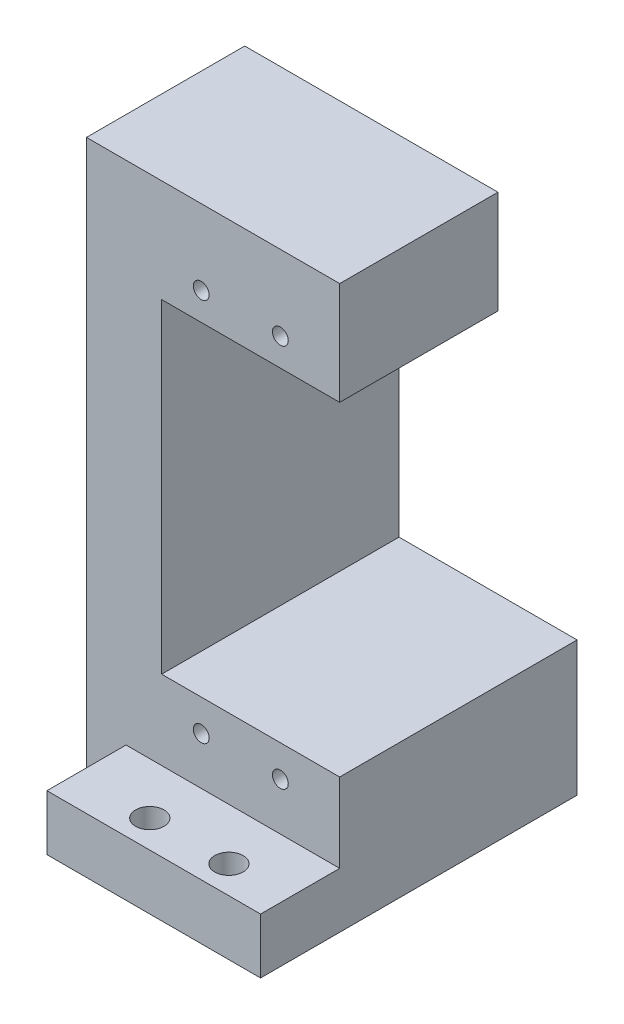
ISO-10303-21;
HEADER;
FILE_DESCRIPTION(('STEP AP214'),'2;1');
FILE_NAME('part.step','',(''),(''),'','','');
FILE_SCHEMA(('AUTOMOTIVE_DESIGN { 1 0 10303 214 1 1 1 1 }'));
ENDSEC;
DATA;
#1=APPLICATION_CONTEXT('core data for automotive mechanical design processes');
#2=APPLICATION_PROTOCOL_DEFINITION('international standard','automotive_design',2000,#1);
#3=PRODUCT_CONTEXT('',#1,'mechanical');
#4=PRODUCT('Part','Part','',(#3));
#5=PRODUCT_RELATED_PRODUCT_CATEGORY('part','',(#4));
#6=PRODUCT_DEFINITION_FORMATION('','',#4);
#7=PRODUCT_DEFINITION_CONTEXT('part definition',#1,'design');
#8=PRODUCT_DEFINITION('design','',#6,#7);
#9=PRODUCT_DEFINITION_SHAPE('','',#8);
#10=(LENGTH_UNIT() NAMED_UNIT(*) SI_UNIT(.MILLI.,.METRE.));
#11=(NAMED_UNIT(*) PLANE_ANGLE_UNIT() SI_UNIT($,.RADIAN.));
#12=(NAMED_UNIT(*) SI_UNIT($,.STERADIAN.) SOLID_ANGLE_UNIT());
#13=UNCERTAINTY_MEASURE_WITH_UNIT(LENGTH_MEASURE(1.E-05),#10,'distance_accuracy_value','');
#14=(GEOMETRIC_REPRESENTATION_CONTEXT(3) GLOBAL_UNCERTAINTY_ASSIGNED_CONTEXT((#13)) GLOBAL_UNIT_ASSIGNED_CONTEXT((#10,
#11,#12)) REPRESENTATION_CONTEXT('',''));
#15=CARTESIAN_POINT('',(0.,0.,0.));
#16=DIRECTION('',(0.,0.,1.));
#17=DIRECTION('',(1.,0.,0.));
#18=AXIS2_PLACEMENT_3D('',#15,#16,#17);
#19=CARTESIAN_POINT('',(0.,50.,-40.));
#20=DIRECTION('',(0.,0.,1.));
#21=DIRECTION('',(1.,0.,0.));
#22=AXIS2_PLACEMENT_3D('',#19,#20,#21);
#23=PLANE('',#22);
#24=DIRECTION('',(1.,0.,0.));
#25=VECTOR('',#24,1.);
#26=CARTESIAN_POINT('',(-7.,66.,-40.));
#27=LINE('',#26,#25);
#28=CARTESIAN_POINT('',(-7.,66.,-40.));
#29=VERTEX_POINT('',#28);
#30=CARTESIAN_POINT('',(2.5,66.,-40.));
#31=VERTEX_POINT('',#30);
#32=EDGE_CURVE('E56',#29,#31,#27,.T.);
#33=ORIENTED_EDGE('',*,*,#32,.T.);
#34=DIRECTION('',(0.,1.,0.));
#35=VECTOR('',#34,1.);
#36=CARTESIAN_POINT('',(2.5,25.,-40.));
#37=LINE('',#36,#35);
#38=CARTESIAN_POINT('',(2.5,25.,-40.));
#39=VERTEX_POINT('',#38);
#40=EDGE_CURVE('E362',#39,#31,#37,.T.);
#41=ORIENTED_EDGE('',*,*,#40,.F.);
#42=DIRECTION('',(-1.,0.,0.));
#43=VECTOR('',#42,1.);
#44=CARTESIAN_POINT('',(2.5,25.,-40.));
#45=LINE('',#44,#43);
#46=CARTESIAN_POINT('',(25.,25.,-40.));
#47=VERTEX_POINT('',#46);
#48=EDGE_CURVE('E358',#47,#39,#45,.T.);
#49=ORIENTED_EDGE('',*,*,#48,.F.);
#50=DIRECTION('',(0.,-1.,0.));
#51=VECTOR('',#50,1.);
#52=CARTESIAN_POINT('',(25.,50.,-40.));
#53=LINE('',#52,#51);
#54=CARTESIAN_POINT('',(25.,7.99999999999998,-40.));
#55=VERTEX_POINT('',#54);
#56=EDGE_CURVE('E49',#47,#55,#53,.T.);
#57=ORIENTED_EDGE('',*,*,#56,.T.);
#58=DIRECTION('',(1.,0.,0.));
#59=VECTOR('',#58,1.);
#60=CARTESIAN_POINT('',(0.,7.99999999999998,-40.));
#61=LINE('',#60,#59);
#62=CARTESIAN_POINT('',(-7.,7.99999999999998,-40.));
#63=VERTEX_POINT('',#62);
#64=EDGE_CURVE('E305',#63,#55,#61,.T.);
#65=ORIENTED_EDGE('',*,*,#64,.F.);
#66=DIRECTION('',(0.,-1.,0.));
#67=VECTOR('',#66,1.);
#68=CARTESIAN_POINT('',(-7.,79.,-40.));
#69=LINE('',#68,#67);
#70=EDGE_CURVE('E196',#29,#63,#69,.T.);
#71=ORIENTED_EDGE('',*,*,#70,.F.);
#72=EDGE_LOOP('',(#33,#41,#49,#57,#65,#71));
#73=FACE_BOUND('',#72,.T.);
#74=ADVANCED_FACE('F40',(#73),#23,.F.);
#75=CARTESIAN_POINT('',(2.5,25.,0.));
#76=DIRECTION('',(-1.,0.,0.));
#77=DIRECTION('',(0.,0.,1.));
#78=AXIS2_PLACEMENT_3D('',#75,#76,#77);
#79=PLANE('',#78);
#80=DIRECTION('',(0.,0.,-1.));
#81=VECTOR('',#80,1.);
#82=CARTESIAN_POINT('',(2.5,66.,0.));
#83=LINE('',#82,#81);
#84=CARTESIAN_POINT('',(2.5,66.,-10.));
#85=VERTEX_POINT('',#84);
#86=CARTESIAN_POINT('',(2.5,66.,-30.));
#87=VERTEX_POINT('',#86);
#88=EDGE_CURVE('E232',#85,#87,#83,.T.);
#89=ORIENTED_EDGE('',*,*,#88,.F.);
#90=DIRECTION('',(0.,1.,0.));
#91=VECTOR('',#90,1.);
#92=CARTESIAN_POINT('',(2.5,69.,-10.));
#93=LINE('',#92,#91);
#94=CARTESIAN_POINT('',(2.5,25.,-10.));
#95=VERTEX_POINT('',#94);
#96=EDGE_CURVE('E219',#95,#85,#93,.T.);
#97=ORIENTED_EDGE('',*,*,#96,.F.);
#98=DIRECTION('',(0.,0.,1.));
#99=VECTOR('',#98,1.);
#100=CARTESIAN_POINT('',(2.5,25.,0.));
#101=LINE('',#100,#99);
#102=EDGE_CURVE('E349',#39,#95,#101,.T.);
#103=ORIENTED_EDGE('',*,*,#102,.F.);
#104=ORIENTED_EDGE('',*,*,#40,.T.);
#105=DIRECTION('',(0.,0.,-1.));
#106=VECTOR('',#105,1.);
#107=CARTESIAN_POINT('',(2.5,66.,0.));
#108=LINE('',#107,#106);
#109=EDGE_CURVE('E197',#87,#31,#108,.T.);
#110=ORIENTED_EDGE('',*,*,#109,.F.);
#111=EDGE_LOOP('',(#89,#97,#103,#104,#110));
#112=FACE_BOUND('',#111,.T.);
#113=ADVANCED_FACE('F411',(#112),#79,.F.);
#114=CARTESIAN_POINT('',(0.,50.,0.));
#115=DIRECTION('',(0.,0.,-1.));
#116=DIRECTION('',(-1.,0.,0.));
#117=AXIS2_PLACEMENT_3D('',#114,#115,#116);
#118=PLANE('',#117);
#119=DIRECTION('',(1.,0.,0.));
#120=VECTOR('',#119,1.);
#121=CARTESIAN_POINT('',(2.5,15.,0.));
#122=LINE('',#121,#120);
#123=CARTESIAN_POINT('',(-2.,15.,0.));
#124=VERTEX_POINT('',#123);
#125=CARTESIAN_POINT('',(25.,15.,0.));
#126=VERTEX_POINT('',#125);
#127=EDGE_CURVE('E330',#124,#126,#122,.T.);
#128=ORIENTED_EDGE('',*,*,#127,.F.);
#129=DIRECTION('',(0.,1.,0.));
#130=VECTOR('',#129,1.);
#131=CARTESIAN_POINT('',(-2.,69.,0.));
#132=LINE('',#131,#130);
#133=CARTESIAN_POINT('',(-2.,7.99999999999998,0.));
#134=VERTEX_POINT('',#133);
#135=EDGE_CURVE('E242',#134,#124,#132,.T.);
#136=ORIENTED_EDGE('',*,*,#135,.F.);
#137=DIRECTION('',(-1.,0.,0.));
#138=VECTOR('',#137,1.);
#139=CARTESIAN_POINT('',(0.,7.99999999999998,0.));
#140=LINE('',#139,#138);
#141=CARTESIAN_POINT('',(25.,7.99999999999998,0.));
#142=VERTEX_POINT('',#141);
#143=EDGE_CURVE('E321',#142,#134,#140,.T.);
#144=ORIENTED_EDGE('',*,*,#143,.F.);
#145=DIRECTION('',(0.,-1.,0.));
#146=VECTOR('',#145,1.);
#147=CARTESIAN_POINT('',(25.,50.,0.));
#148=LINE('',#147,#146);
#149=EDGE_CURVE('E11',#126,#142,#148,.T.);
#150=ORIENTED_EDGE('',*,*,#149,.F.);
#151=EDGE_LOOP('',(#128,#136,#144,#150));
#152=FACE_BOUND('',#151,.T.);
#153=ADVANCED_FACE('F42',(#152),#118,.F.);
#154=CARTESIAN_POINT('',(25.,50.,0.));
#155=DIRECTION('',(-1.,0.,0.));
#156=DIRECTION('',(0.,0.,1.));
#157=AXIS2_PLACEMENT_3D('',#154,#155,#156);
#158=PLANE('',#157);
#159=DIRECTION('',(0.,0.,-1.));
#160=VECTOR('',#159,1.);
#161=CARTESIAN_POINT('',(25.,25.,0.));
#162=LINE('',#161,#160);
#163=CARTESIAN_POINT('',(25.,25.,-10.));
#164=VERTEX_POINT('',#163);
#165=EDGE_CURVE('E355',#164,#47,#162,.T.);
#166=ORIENTED_EDGE('',*,*,#165,.F.);
#167=DIRECTION('',(0.,-1.,0.));
#168=VECTOR('',#167,1.);
#169=CARTESIAN_POINT('',(25.,50.,-10.));
#170=LINE('',#169,#168);
#171=CARTESIAN_POINT('',(25.,15.,-10.));
#172=VERTEX_POINT('',#171);
#173=EDGE_CURVE('E250',#164,#172,#170,.T.);
#174=ORIENTED_EDGE('',*,*,#173,.T.);
#175=DIRECTION('',(0.,0.,1.));
#176=VECTOR('',#175,1.);
#177=CARTESIAN_POINT('',(25.,15.,0.));
#178=LINE('',#177,#176);
#179=EDGE_CURVE('E246',#172,#126,#178,.T.);
#180=ORIENTED_EDGE('',*,*,#179,.T.);
#181=ORIENTED_EDGE('',*,*,#149,.T.);
#182=DIRECTION('',(0.,0.,1.));
#183=VECTOR('',#182,1.);
#184=CARTESIAN_POINT('',(25.,7.99999999999998,0.));
#185=LINE('',#184,#183);
#186=EDGE_CURVE('E317',#55,#142,#185,.T.);
#187=ORIENTED_EDGE('',*,*,#186,.F.);
#188=ORIENTED_EDGE('',*,*,#56,.F.);
#189=EDGE_LOOP('',(#166,#174,#180,#181,#187,#188));
#190=FACE_BOUND('',#189,.T.);
#191=ADVANCED_FACE('F377',(#190),#158,.F.);
#192=CARTESIAN_POINT('',(0.,25.,0.));
#193=DIRECTION('',(0.,-1.,0.));
#194=DIRECTION('',(0.,0.,-1.));
#195=AXIS2_PLACEMENT_3D('',#192,#193,#194);
#196=PLANE('',#195);
#197=DIRECTION('',(-1.,0.,0.));
#198=VECTOR('',#197,1.);
#199=CARTESIAN_POINT('',(2.5,25.,-10.));
#200=LINE('',#199,#198);
#201=EDGE_CURVE('E345',#164,#95,#200,.T.);
#202=ORIENTED_EDGE('',*,*,#201,.F.);
#203=ORIENTED_EDGE('',*,*,#165,.T.);
#204=ORIENTED_EDGE('',*,*,#48,.T.);
#205=ORIENTED_EDGE('',*,*,#102,.T.);
#206=EDGE_LOOP('',(#202,#203,#204,#205));
#207=FACE_BOUND('',#206,.T.);
#208=ADVANCED_FACE('F413',(#207),#196,.F.);
#209=CARTESIAN_POINT('',(2.5,15.,-10.));
#210=DIRECTION('',(0.,-1.,0.));
#211=DIRECTION('',(0.,0.,-1.));
#212=AXIS2_PLACEMENT_3D('',#209,#210,#211);
#213=PLANE('',#212);
#214=CARTESIAN_POINT('',(7.5,15.,-3.5));
#215=DIRECTION('',(0.,1.,0.));
#216=DIRECTION('',(0.,0.,1.));
#217=AXIS2_PLACEMENT_3D('',#214,#215,#216);
#218=CIRCLE('',#217,1.8);
#219=CARTESIAN_POINT('',(7.5,15.,-1.7));
#220=VERTEX_POINT('',#219);
#221=EDGE_CURVE('E260',#220,#220,#218,.T.);
#222=ORIENTED_EDGE('',*,*,#221,.F.);
#223=EDGE_LOOP('',(#222));
#224=FACE_BOUND('',#223,.T.);
#225=CARTESIAN_POINT('',(17.5,15.,-3.5));
#226=DIRECTION('',(0.,1.,0.));
#227=DIRECTION('',(0.,0.,1.));
#228=AXIS2_PLACEMENT_3D('',#225,#226,#227);
#229=CIRCLE('',#228,1.8);
#230=CARTESIAN_POINT('',(17.5,15.,-1.7));
#231=VERTEX_POINT('',#230);
#232=EDGE_CURVE('E254',#231,#231,#229,.T.);
#233=ORIENTED_EDGE('',*,*,#232,.F.);
#234=EDGE_LOOP('',(#233));
#235=FACE_BOUND('',#234,.T.);
#236=ORIENTED_EDGE('',*,*,#127,.T.);
#237=ORIENTED_EDGE('',*,*,#179,.F.);
#238=DIRECTION('',(1.,0.,0.));
#239=VECTOR('',#238,1.);
#240=CARTESIAN_POINT('',(2.5,15.,-10.));
#241=LINE('',#240,#239);
#242=CARTESIAN_POINT('',(-2.,15.,-10.));
#243=VERTEX_POINT('',#242);
#244=EDGE_CURVE('E342',#243,#172,#241,.T.);
#245=ORIENTED_EDGE('',*,*,#244,.F.);
#246=DIRECTION('',(0.,0.,-1.));
#247=VECTOR('',#246,1.);
#248=CARTESIAN_POINT('',(-2.,15.,0.));
#249=LINE('',#248,#247);
#250=EDGE_CURVE('E220',#124,#243,#249,.T.);
#251=ORIENTED_EDGE('',*,*,#250,.F.);
#252=EDGE_LOOP('',(#236,#237,#245,#251));
#253=FACE_BOUND('',#252,.T.);
#254=ADVANCED_FACE('F417',(#224,#235,#253),#213,.F.);
#255=CARTESIAN_POINT('',(0.,0.,-10.));
#256=DIRECTION('',(0.,0.,1.));
#257=DIRECTION('',(1.,0.,0.));
#258=AXIS2_PLACEMENT_3D('',#255,#256,#257);
#259=PLANE('',#258);
#260=CARTESIAN_POINT('',(7.5,69.5,-10.));
#261=DIRECTION('',(0.,0.,-1.));
#262=DIRECTION('',(1.,0.,0.));
#263=AXIS2_PLACEMENT_3D('',#260,#261,#262);
#264=CIRCLE('',#263,1.);
#265=CARTESIAN_POINT('',(8.5,69.5,-10.));
#266=VERTEX_POINT('',#265);
#267=EDGE_CURVE('E204',#266,#266,#264,.T.);
#268=ORIENTED_EDGE('',*,*,#267,.T.);
#269=EDGE_LOOP('',(#268));
#270=FACE_BOUND('',#269,.T.);
#271=CARTESIAN_POINT('',(17.5,69.5,-10.));
#272=DIRECTION('',(0.,0.,-1.));
#273=DIRECTION('',(1.,0.,0.));
#274=AXIS2_PLACEMENT_3D('',#271,#272,#273);
#275=CIRCLE('',#274,1.);
#276=CARTESIAN_POINT('',(18.5,69.5,-10.));
#277=VERTEX_POINT('',#276);
#278=EDGE_CURVE('E189',#277,#277,#275,.T.);
#279=ORIENTED_EDGE('',*,*,#278,.T.);
#280=EDGE_LOOP('',(#279));
#281=FACE_BOUND('',#280,.T.);
#282=CARTESIAN_POINT('',(7.5,21.,-10.));
#283=DIRECTION('',(0.,0.,1.));
#284=DIRECTION('',(1.,0.,0.));
#285=AXIS2_PLACEMENT_3D('',#282,#283,#284);
#286=CIRCLE('',#285,1.);
#287=CARTESIAN_POINT('',(8.5,21.,-10.));
#288=VERTEX_POINT('',#287);
#289=EDGE_CURVE('E331',#288,#288,#286,.T.);
#290=ORIENTED_EDGE('',*,*,#289,.F.);
#291=EDGE_LOOP('',(#290));
#292=FACE_BOUND('',#291,.T.);
#293=CARTESIAN_POINT('',(17.5,21.,-10.));
#294=DIRECTION('',(0.,0.,1.));
#295=DIRECTION('',(1.,0.,0.));
#296=AXIS2_PLACEMENT_3D('',#293,#294,#295);
#297=CIRCLE('',#296,1.);
#298=CARTESIAN_POINT('',(18.5,21.,-10.));
#299=VERTEX_POINT('',#298);
#300=EDGE_CURVE('E325',#299,#299,#297,.T.);
#301=ORIENTED_EDGE('',*,*,#300,.F.);
#302=EDGE_LOOP('',(#301));
#303=FACE_BOUND('',#302,.T.);
#304=ORIENTED_EDGE('',*,*,#201,.T.);
#305=ORIENTED_EDGE('',*,*,#96,.T.);
#306=DIRECTION('',(1.,0.,0.));
#307=VECTOR('',#306,1.);
#308=CARTESIAN_POINT('',(-7.94030650891055,66.,-10.));
#309=LINE('',#308,#307);
#310=CARTESIAN_POINT('',(25.,66.,-10.));
#311=VERTEX_POINT('',#310);
#312=EDGE_CURVE('E228',#85,#311,#309,.T.);
#313=ORIENTED_EDGE('',*,*,#312,.T.);
#314=DIRECTION('',(0.,1.,0.));
#315=VECTOR('',#314,1.);
#316=CARTESIAN_POINT('',(25.,69.,-10.));
#317=LINE('',#316,#315);
#318=CARTESIAN_POINT('',(25.,79.,-10.));
#319=VERTEX_POINT('',#318);
#320=EDGE_CURVE('E223',#311,#319,#317,.T.);
#321=ORIENTED_EDGE('',*,*,#320,.T.);
#322=DIRECTION('',(1.,0.,0.));
#323=VECTOR('',#322,1.);
#324=CARTESIAN_POINT('',(-2.,79.,-10.));
#325=LINE('',#324,#323);
#326=CARTESIAN_POINT('',(-7.,79.,-10.));
#327=VERTEX_POINT('',#326);
#328=EDGE_CURVE('E203',#327,#319,#325,.T.);
#329=ORIENTED_EDGE('',*,*,#328,.F.);
#330=DIRECTION('',(0.,1.,0.));
#331=VECTOR('',#330,1.);
#332=CARTESIAN_POINT('',(-7.,79.,-10.));
#333=LINE('',#332,#331);
#334=CARTESIAN_POINT('',(-7.,7.99999999999998,-10.));
#335=VERTEX_POINT('',#334);
#336=EDGE_CURVE('E182',#335,#327,#333,.T.);
#337=ORIENTED_EDGE('',*,*,#336,.F.);
#338=DIRECTION('',(1.,0.,0.));
#339=VECTOR('',#338,1.);
#340=CARTESIAN_POINT('',(-7.,7.99999999999998,-10.));
#341=LINE('',#340,#339);
#342=CARTESIAN_POINT('',(-2.,7.99999999999998,-10.));
#343=VERTEX_POINT('',#342);
#344=EDGE_CURVE('E184',#335,#343,#341,.T.);
#345=ORIENTED_EDGE('',*,*,#344,.T.);
#346=DIRECTION('',(0.,1.,0.));
#347=VECTOR('',#346,1.);
#348=CARTESIAN_POINT('',(-2.,79.,-10.));
#349=LINE('',#348,#347);
#350=EDGE_CURVE('E64',#343,#243,#349,.T.);
#351=ORIENTED_EDGE('',*,*,#350,.T.);
#352=ORIENTED_EDGE('',*,*,#244,.T.);
#353=ORIENTED_EDGE('',*,*,#173,.F.);
#354=EDGE_LOOP('',(#304,#305,#313,#321,#329,#337,#345,#351,#352,#353));
#355=FACE_BOUND('',#354,.T.);
#356=ADVANCED_FACE('F388',(#270,#281,#292,#303,#355),#259,.T.);
#357=CARTESIAN_POINT('',(17.5,21.,-22.));
#358=DIRECTION('',(0.,0.,1.));
#359=DIRECTION('',(1.,0.,0.));
#360=AXIS2_PLACEMENT_3D('',#357,#358,#359);
#361=CYLINDRICAL_SURFACE('',#360,1.);
#362=CARTESIAN_POINT('',(17.5,21.,-22.));
#363=DIRECTION('',(0.,0.,1.));
#364=DIRECTION('',(1.,0.,0.));
#365=AXIS2_PLACEMENT_3D('',#362,#363,#364);
#366=CIRCLE('',#365,1.);
#367=CARTESIAN_POINT('',(18.5,21.,-22.));
#368=VERTEX_POINT('',#367);
#369=EDGE_CURVE('E335',#368,#368,#366,.T.);
#370=ORIENTED_EDGE('',*,*,#369,.F.);
#371=EDGE_LOOP('',(#370));
#372=FACE_BOUND('',#371,.T.);
#373=ORIENTED_EDGE('',*,*,#300,.T.);
#374=EDGE_LOOP('',(#373));
#375=FACE_BOUND('',#374,.T.);
#376=ADVANCED_FACE('F425',(#372,#375),#361,.F.);
#377=CARTESIAN_POINT('',(17.5,21.,-22.));
#378=DIRECTION('',(0.,0.,1.));
#379=DIRECTION('',(1.,0.,0.));
#380=AXIS2_PLACEMENT_3D('',#377,#378,#379);
#381=PLANE('',#380);
#382=ORIENTED_EDGE('',*,*,#369,.T.);
#383=EDGE_LOOP('',(#382));
#384=FACE_BOUND('',#383,.T.);
#385=ADVANCED_FACE('F571',(#384),#381,.T.);
#386=CARTESIAN_POINT('',(7.5,21.,-22.));
#387=DIRECTION('',(0.,0.,1.));
#388=DIRECTION('',(1.,0.,0.));
#389=AXIS2_PLACEMENT_3D('',#386,#387,#388);
#390=CYLINDRICAL_SURFACE('',#389,1.);
#391=CARTESIAN_POINT('',(7.5,21.,-22.));
#392=DIRECTION('',(0.,0.,1.));
#393=DIRECTION('',(1.,0.,0.));
#394=AXIS2_PLACEMENT_3D('',#391,#392,#393);
#395=CIRCLE('',#394,1.);
#396=CARTESIAN_POINT('',(8.5,21.,-22.));
#397=VERTEX_POINT('',#396);
#398=EDGE_CURVE('E326',#397,#397,#395,.T.);
#399=ORIENTED_EDGE('',*,*,#398,.F.);
#400=EDGE_LOOP('',(#399));
#401=FACE_BOUND('',#400,.T.);
#402=ORIENTED_EDGE('',*,*,#289,.T.);
#403=EDGE_LOOP('',(#402));
#404=FACE_BOUND('',#403,.T.);
#405=ADVANCED_FACE('F567',(#401,#404),#390,.F.);
#406=CARTESIAN_POINT('',(7.5,21.,-22.));
#407=DIRECTION('',(0.,0.,1.));
#408=DIRECTION('',(1.,0.,0.));
#409=AXIS2_PLACEMENT_3D('',#406,#407,#408);
#410=PLANE('',#409);
#411=ORIENTED_EDGE('',*,*,#398,.T.);
#412=EDGE_LOOP('',(#411));
#413=FACE_BOUND('',#412,.T.);
#414=ADVANCED_FACE('F563',(#413),#410,.T.);
#415=CARTESIAN_POINT('',(0.,7.99999999999998,0.));
#416=DIRECTION('',(0.,-1.,0.));
#417=DIRECTION('',(0.,0.,-1.));
#418=AXIS2_PLACEMENT_3D('',#415,#416,#417);
#419=PLANE('',#418);
#420=CARTESIAN_POINT('',(7.5,7.99999999999998,-3.5));
#421=DIRECTION('',(0.,1.,0.));
#422=DIRECTION('',(0.,0.,1.));
#423=AXIS2_PLACEMENT_3D('',#420,#421,#422);
#424=CIRCLE('',#423,1.8);
#425=CARTESIAN_POINT('',(7.5,7.99999999999998,-1.7));
#426=VERTEX_POINT('',#425);
#427=EDGE_CURVE('E255',#426,#426,#424,.T.);
#428=ORIENTED_EDGE('',*,*,#427,.T.);
#429=EDGE_LOOP('',(#428));
#430=FACE_BOUND('',#429,.T.);
#431=CARTESIAN_POINT('',(17.5,7.99999999999998,-3.5));
#432=DIRECTION('',(0.,1.,0.));
#433=DIRECTION('',(0.,0.,1.));
#434=AXIS2_PLACEMENT_3D('',#431,#432,#433);
#435=CIRCLE('',#434,1.8);
#436=CARTESIAN_POINT('',(17.5,7.99999999999998,-1.7));
#437=VERTEX_POINT('',#436);
#438=EDGE_CURVE('E264',#437,#437,#435,.T.);
#439=ORIENTED_EDGE('',*,*,#438,.T.);
#440=EDGE_LOOP('',(#439));
#441=FACE_BOUND('',#440,.T.);
#442=DIRECTION('',(0.,0.,-1.));
#443=VECTOR('',#442,1.);
#444=CARTESIAN_POINT('',(2.5,7.99999999999998,-37.5));
#445=LINE('',#444,#443);
#446=CARTESIAN_POINT('',(2.5,7.99999999999998,-15.));
#447=VERTEX_POINT('',#446);
#448=CARTESIAN_POINT('',(2.5,7.99999999999998,-37.5));
#449=VERTEX_POINT('',#448);
#450=EDGE_CURVE('E259',#447,#449,#445,.T.);
#451=ORIENTED_EDGE('',*,*,#450,.F.);
#452=DIRECTION('',(-1.,0.,0.));
#453=VECTOR('',#452,1.);
#454=CARTESIAN_POINT('',(2.5,7.99999999999998,-15.));
#455=LINE('',#454,#453);
#456=CARTESIAN_POINT('',(22.5,7.99999999999998,-15.));
#457=VERTEX_POINT('',#456);
#458=EDGE_CURVE('E276',#457,#447,#455,.T.);
#459=ORIENTED_EDGE('',*,*,#458,.F.);
#460=DIRECTION('',(0.,0.,1.));
#461=VECTOR('',#460,1.);
#462=CARTESIAN_POINT('',(22.5,7.99999999999998,-37.5));
#463=LINE('',#462,#461);
#464=CARTESIAN_POINT('',(22.5,7.99999999999998,-37.5));
#465=VERTEX_POINT('',#464);
#466=EDGE_CURVE('E295',#465,#457,#463,.T.);
#467=ORIENTED_EDGE('',*,*,#466,.F.);
#468=DIRECTION('',(1.,0.,0.));
#469=VECTOR('',#468,1.);
#470=CARTESIAN_POINT('',(2.5,7.99999999999998,-37.5));
#471=LINE('',#470,#469);
#472=EDGE_CURVE('E291',#449,#465,#471,.T.);
#473=ORIENTED_EDGE('',*,*,#472,.F.);
#474=EDGE_LOOP('',(#451,#459,#467,#473));
#475=FACE_BOUND('',#474,.T.);
#476=ORIENTED_EDGE('',*,*,#143,.T.);
#477=DIRECTION('',(0.,0.,1.));
#478=VECTOR('',#477,1.);
#479=CARTESIAN_POINT('',(-2.,7.99999999999998,-40.));
#480=LINE('',#479,#478);
#481=EDGE_CURVE('E236',#343,#134,#480,.T.);
#482=ORIENTED_EDGE('',*,*,#481,.F.);
#483=ORIENTED_EDGE('',*,*,#344,.F.);
#484=DIRECTION('',(0.,0.,1.));
#485=VECTOR('',#484,1.);
#486=CARTESIAN_POINT('',(-7.,7.99999999999998,-40.));
#487=LINE('',#486,#485);
#488=EDGE_CURVE('E191',#63,#335,#487,.T.);
#489=ORIENTED_EDGE('',*,*,#488,.F.);
#490=ORIENTED_EDGE('',*,*,#64,.T.);
#491=ORIENTED_EDGE('',*,*,#186,.T.);
#492=EDGE_LOOP('',(#476,#482,#483,#489,#490,#491));
#493=FACE_BOUND('',#492,.T.);
#494=ADVANCED_FACE('F381',(#430,#441,#475,#493),#419,.T.);
#495=CARTESIAN_POINT('',(2.5,16.,-37.5));
#496=DIRECTION('',(-1.,0.,0.));
#497=DIRECTION('',(0.,0.,1.));
#498=AXIS2_PLACEMENT_3D('',#495,#496,#497);
#499=PLANE('',#498);
#500=ORIENTED_EDGE('',*,*,#450,.T.);
#501=DIRECTION('',(0.,-1.,0.));
#502=VECTOR('',#501,1.);
#503=CARTESIAN_POINT('',(2.5,16.,-37.5));
#504=LINE('',#503,#502);
#505=CARTESIAN_POINT('',(2.5,16.,-37.5));
#506=VERTEX_POINT('',#505);
#507=EDGE_CURVE('E288',#506,#449,#504,.T.);
#508=ORIENTED_EDGE('',*,*,#507,.F.);
#509=DIRECTION('',(0.,0.,-1.));
#510=VECTOR('',#509,1.);
#511=CARTESIAN_POINT('',(2.5,16.,-37.5));
#512=LINE('',#511,#510);
#513=CARTESIAN_POINT('',(2.5,16.,-15.));
#514=VERTEX_POINT('',#513);
#515=EDGE_CURVE('E271',#514,#506,#512,.T.);
#516=ORIENTED_EDGE('',*,*,#515,.F.);
#517=DIRECTION('',(0.,-1.,0.));
#518=VECTOR('',#517,1.);
#519=CARTESIAN_POINT('',(2.5,16.,-15.));
#520=LINE('',#519,#518);
#521=EDGE_CURVE('E302',#514,#447,#520,.T.);
#522=ORIENTED_EDGE('',*,*,#521,.T.);
#523=EDGE_LOOP('',(#500,#508,#516,#522));
#524=FACE_BOUND('',#523,.T.);
#525=ADVANCED_FACE('F550',(#524),#499,.F.);
#526=CARTESIAN_POINT('',(2.5,16.,-15.));
#527=DIRECTION('',(0.,0.,1.));
#528=DIRECTION('',(1.,0.,0.));
#529=AXIS2_PLACEMENT_3D('',#526,#527,#528);
#530=PLANE('',#529);
#531=ORIENTED_EDGE('',*,*,#458,.T.);
#532=ORIENTED_EDGE('',*,*,#521,.F.);
#533=DIRECTION('',(-1.,0.,0.));
#534=VECTOR('',#533,1.);
#535=CARTESIAN_POINT('',(2.5,16.,-15.));
#536=LINE('',#535,#534);
#537=CARTESIAN_POINT('',(22.5,16.,-15.));
#538=VERTEX_POINT('',#537);
#539=EDGE_CURVE('E284',#538,#514,#536,.T.);
#540=ORIENTED_EDGE('',*,*,#539,.F.);
#541=DIRECTION('',(0.,-1.,0.));
#542=VECTOR('',#541,1.);
#543=CARTESIAN_POINT('',(22.5,16.,-15.));
#544=LINE('',#543,#542);
#545=EDGE_CURVE('E306',#538,#457,#544,.T.);
#546=ORIENTED_EDGE('',*,*,#545,.T.);
#547=EDGE_LOOP('',(#531,#532,#540,#546));
#548=FACE_BOUND('',#547,.T.);
#549=ADVANCED_FACE('F546',(#548),#530,.F.);
#550=CARTESIAN_POINT('',(22.5,16.,-37.5));
#551=DIRECTION('',(1.,0.,0.));
#552=DIRECTION('',(0.,0.,-1.));
#553=AXIS2_PLACEMENT_3D('',#550,#551,#552);
#554=PLANE('',#553);
#555=ORIENTED_EDGE('',*,*,#466,.T.);
#556=ORIENTED_EDGE('',*,*,#545,.F.);
#557=DIRECTION('',(0.,0.,1.));
#558=VECTOR('',#557,1.);
#559=CARTESIAN_POINT('',(22.5,16.,-37.5));
#560=LINE('',#559,#558);
#561=CARTESIAN_POINT('',(22.5,16.,-37.5));
#562=VERTEX_POINT('',#561);
#563=EDGE_CURVE('E280',#562,#538,#560,.T.);
#564=ORIENTED_EDGE('',*,*,#563,.F.);
#565=DIRECTION('',(0.,-1.,0.));
#566=VECTOR('',#565,1.);
#567=CARTESIAN_POINT('',(22.5,16.,-37.5));
#568=LINE('',#567,#566);
#569=EDGE_CURVE('E309',#562,#465,#568,.T.);
#570=ORIENTED_EDGE('',*,*,#569,.T.);
#571=EDGE_LOOP('',(#555,#556,#564,#570));
#572=FACE_BOUND('',#571,.T.);
#573=ADVANCED_FACE('F549',(#572),#554,.F.);
#574=CARTESIAN_POINT('',(2.5,16.,-37.5));
#575=DIRECTION('',(0.,0.,-1.));
#576=DIRECTION('',(-1.,0.,0.));
#577=AXIS2_PLACEMENT_3D('',#574,#575,#576);
#578=PLANE('',#577);
#579=ORIENTED_EDGE('',*,*,#472,.T.);
#580=ORIENTED_EDGE('',*,*,#569,.F.);
#581=DIRECTION('',(1.,0.,0.));
#582=VECTOR('',#581,1.);
#583=CARTESIAN_POINT('',(2.5,16.,-37.5));
#584=LINE('',#583,#582);
#585=EDGE_CURVE('E275',#506,#562,#584,.T.);
#586=ORIENTED_EDGE('',*,*,#585,.F.);
#587=ORIENTED_EDGE('',*,*,#507,.T.);
#588=EDGE_LOOP('',(#579,#580,#586,#587));
#589=FACE_BOUND('',#588,.T.);
#590=ADVANCED_FACE('F544',(#589),#578,.F.);
#591=CARTESIAN_POINT('',(0.,16.,0.));
#592=DIRECTION('',(0.,1.,0.));
#593=DIRECTION('',(0.,0.,1.));
#594=AXIS2_PLACEMENT_3D('',#591,#592,#593);
#595=PLANE('',#594);
#596=ORIENTED_EDGE('',*,*,#515,.T.);
#597=ORIENTED_EDGE('',*,*,#585,.T.);
#598=ORIENTED_EDGE('',*,*,#563,.T.);
#599=ORIENTED_EDGE('',*,*,#539,.T.);
#600=EDGE_LOOP('',(#596,#597,#598,#599));
#601=FACE_BOUND('',#600,.T.);
#602=ADVANCED_FACE('F540',(#601),#595,.F.);
#603=CARTESIAN_POINT('',(17.5,7.99999999999998,-3.5));
#604=DIRECTION('',(0.,1.,0.));
#605=DIRECTION('',(0.,0.,1.));
#606=AXIS2_PLACEMENT_3D('',#603,#604,#605);
#607=CYLINDRICAL_SURFACE('',#606,1.8);
#608=ORIENTED_EDGE('',*,*,#438,.F.);
#609=EDGE_LOOP('',(#608));
#610=FACE_BOUND('',#609,.T.);
#611=ORIENTED_EDGE('',*,*,#232,.T.);
#612=EDGE_LOOP('',(#611));
#613=FACE_BOUND('',#612,.T.);
#614=ADVANCED_FACE('F536',(#610,#613),#607,.F.);
#615=CARTESIAN_POINT('',(7.5,7.99999999999998,-3.5));
#616=DIRECTION('',(0.,1.,0.));
#617=DIRECTION('',(0.,0.,1.));
#618=AXIS2_PLACEMENT_3D('',#615,#616,#617);
#619=CYLINDRICAL_SURFACE('',#618,1.8);
#620=ORIENTED_EDGE('',*,*,#427,.F.);
#621=EDGE_LOOP('',(#620));
#622=FACE_BOUND('',#621,.T.);
#623=ORIENTED_EDGE('',*,*,#221,.T.);
#624=EDGE_LOOP('',(#623));
#625=FACE_BOUND('',#624,.T.);
#626=ADVANCED_FACE('F533',(#622,#625),#619,.F.);
#627=CARTESIAN_POINT('',(-2.,0.,0.));
#628=DIRECTION('',(-1.,0.,0.));
#629=DIRECTION('',(0.,0.,1.));
#630=AXIS2_PLACEMENT_3D('',#627,#628,#629);
#631=PLANE('',#630);
#632=ORIENTED_EDGE('',*,*,#350,.F.);
#633=ORIENTED_EDGE('',*,*,#481,.T.);
#634=ORIENTED_EDGE('',*,*,#135,.T.);
#635=ORIENTED_EDGE('',*,*,#250,.T.);
#636=EDGE_LOOP('',(#632,#633,#634,#635));
#637=FACE_BOUND('',#636,.T.);
#638=ADVANCED_FACE('F385',(#637),#631,.T.);
#639=CARTESIAN_POINT('',(65.1123422402632,66.,0.));
#640=DIRECTION('',(0.,1.,0.));
#641=DIRECTION('',(0.,0.,1.));
#642=AXIS2_PLACEMENT_3D('',#639,#640,#641);
#643=PLANE('',#642);
#644=ORIENTED_EDGE('',*,*,#88,.T.);
#645=DIRECTION('',(-1.,0.,0.));
#646=VECTOR('',#645,1.);
#647=CARTESIAN_POINT('',(-7.,66.,-30.));
#648=LINE('',#647,#646);
#649=CARTESIAN_POINT('',(25.,66.,-30.));
#650=VERTEX_POINT('',#649);
#651=EDGE_CURVE('E401',#650,#87,#648,.T.);
#652=ORIENTED_EDGE('',*,*,#651,.F.);
#653=DIRECTION('',(0.,0.,1.));
#654=VECTOR('',#653,1.);
#655=CARTESIAN_POINT('',(25.,66.,0.));
#656=LINE('',#655,#654);
#657=EDGE_CURVE('E233',#650,#311,#656,.T.);
#658=ORIENTED_EDGE('',*,*,#657,.T.);
#659=ORIENTED_EDGE('',*,*,#312,.F.);
#660=EDGE_LOOP('',(#644,#652,#658,#659));
#661=FACE_BOUND('',#660,.T.);
#662=ADVANCED_FACE('F459',(#661),#643,.F.);
#663=CARTESIAN_POINT('',(25.,50.,0.));
#664=DIRECTION('',(-1.,0.,0.));
#665=DIRECTION('',(0.,0.,1.));
#666=AXIS2_PLACEMENT_3D('',#663,#664,#665);
#667=PLANE('',#666);
#668=ORIENTED_EDGE('',*,*,#657,.F.);
#669=DIRECTION('',(0.,1.,0.));
#670=VECTOR('',#669,1.);
#671=CARTESIAN_POINT('',(25.,32.4738907715196,-30.));
#672=LINE('',#671,#670);
#673=CARTESIAN_POINT('',(25.,79.,-30.));
#674=VERTEX_POINT('',#673);
#675=EDGE_CURVE('E167',#650,#674,#672,.T.);
#676=ORIENTED_EDGE('',*,*,#675,.T.);
#677=DIRECTION('',(0.,0.,-1.));
#678=VECTOR('',#677,1.);
#679=CARTESIAN_POINT('',(25.,79.,-10.));
#680=LINE('',#679,#678);
#681=EDGE_CURVE('E176',#319,#674,#680,.T.);
#682=ORIENTED_EDGE('',*,*,#681,.F.);
#683=ORIENTED_EDGE('',*,*,#320,.F.);
#684=EDGE_LOOP('',(#668,#676,#682,#683));
#685=FACE_BOUND('',#684,.T.);
#686=ADVANCED_FACE('F392',(#685),#667,.F.);
#687=CARTESIAN_POINT('',(0.,79.,0.));
#688=DIRECTION('',(0.,-1.,0.));
#689=DIRECTION('',(0.,0.,-1.));
#690=AXIS2_PLACEMENT_3D('',#687,#688,#689);
#691=PLANE('',#690);
#692=ORIENTED_EDGE('',*,*,#681,.T.);
#693=DIRECTION('',(1.,0.,0.));
#694=VECTOR('',#693,1.);
#695=CARTESIAN_POINT('',(-7.,79.,-30.));
#696=LINE('',#695,#694);
#697=CARTESIAN_POINT('',(-7.,79.,-30.));
#698=VERTEX_POINT('',#697);
#699=EDGE_CURVE('E161',#698,#674,#696,.T.);
#700=ORIENTED_EDGE('',*,*,#699,.F.);
#701=DIRECTION('',(0.,0.,-1.));
#702=VECTOR('',#701,1.);
#703=CARTESIAN_POINT('',(-7.,79.,-40.));
#704=LINE('',#703,#702);
#705=EDGE_CURVE('E174',#327,#698,#704,.T.);
#706=ORIENTED_EDGE('',*,*,#705,.F.);
#707=ORIENTED_EDGE('',*,*,#328,.T.);
#708=EDGE_LOOP('',(#692,#700,#706,#707));
#709=FACE_BOUND('',#708,.T.);
#710=ADVANCED_FACE('F172',(#709),#691,.F.);
#711=CARTESIAN_POINT('',(17.5,69.5,-22.));
#712=DIRECTION('',(0.,0.,1.));
#713=DIRECTION('',(1.,0.,0.));
#714=AXIS2_PLACEMENT_3D('',#711,#712,#713);
#715=CYLINDRICAL_SURFACE('',#714,1.);
#716=CARTESIAN_POINT('',(17.5,69.5,-22.));
#717=DIRECTION('',(0.,0.,-1.));
#718=DIRECTION('',(1.,0.,0.));
#719=AXIS2_PLACEMENT_3D('',#716,#717,#718);
#720=CIRCLE('',#719,1.);
#721=CARTESIAN_POINT('',(18.5,69.5,-22.));
#722=VERTEX_POINT('',#721);
#723=EDGE_CURVE('E208',#722,#722,#720,.T.);
#724=ORIENTED_EDGE('',*,*,#723,.T.);
#725=EDGE_LOOP('',(#724));
#726=FACE_BOUND('',#725,.T.);
#727=ORIENTED_EDGE('',*,*,#278,.F.);
#728=EDGE_LOOP('',(#727));
#729=FACE_BOUND('',#728,.T.);
#730=ADVANCED_FACE('F485',(#726,#729),#715,.F.);
#731=CARTESIAN_POINT('',(17.5,69.5,-22.));
#732=DIRECTION('',(0.,0.,1.));
#733=DIRECTION('',(1.,0.,0.));
#734=AXIS2_PLACEMENT_3D('',#731,#732,#733);
#735=PLANE('',#734);
#736=ORIENTED_EDGE('',*,*,#723,.F.);
#737=EDGE_LOOP('',(#736));
#738=FACE_BOUND('',#737,.T.);
#739=ADVANCED_FACE('F525',(#738),#735,.T.);
#740=CARTESIAN_POINT('',(7.5,69.5,-22.));
#741=DIRECTION('',(0.,0.,1.));
#742=DIRECTION('',(1.,0.,0.));
#743=AXIS2_PLACEMENT_3D('',#740,#741,#742);
#744=CYLINDRICAL_SURFACE('',#743,1.);
#745=CARTESIAN_POINT('',(7.5,69.5,-22.));
#746=DIRECTION('',(0.,0.,-1.));
#747=DIRECTION('',(1.,0.,0.));
#748=AXIS2_PLACEMENT_3D('',#745,#746,#747);
#749=CIRCLE('',#748,1.);
#750=CARTESIAN_POINT('',(8.5,69.5,-22.));
#751=VERTEX_POINT('',#750);
#752=EDGE_CURVE('E199',#751,#751,#749,.T.);
#753=ORIENTED_EDGE('',*,*,#752,.T.);
#754=EDGE_LOOP('',(#753));
#755=FACE_BOUND('',#754,.T.);
#756=ORIENTED_EDGE('',*,*,#267,.F.);
#757=EDGE_LOOP('',(#756));
#758=FACE_BOUND('',#757,.T.);
#759=ADVANCED_FACE('F521',(#755,#758),#744,.F.);
#760=CARTESIAN_POINT('',(7.5,69.5,-22.));
#761=DIRECTION('',(0.,0.,1.));
#762=DIRECTION('',(1.,0.,0.));
#763=AXIS2_PLACEMENT_3D('',#760,#761,#762);
#764=PLANE('',#763);
#765=ORIENTED_EDGE('',*,*,#752,.F.);
#766=EDGE_LOOP('',(#765));
#767=FACE_BOUND('',#766,.T.);
#768=ADVANCED_FACE('F497',(#767),#764,.T.);
#769=CARTESIAN_POINT('',(-7.,0.,0.));
#770=DIRECTION('',(-1.,0.,0.));
#771=DIRECTION('',(0.,0.,1.));
#772=AXIS2_PLACEMENT_3D('',#769,#770,#771);
#773=PLANE('',#772);
#774=DIRECTION('',(0.,1.,0.));
#775=VECTOR('',#774,1.);
#776=CARTESIAN_POINT('',(-7.,32.4738907715196,-30.));
#777=LINE('',#776,#775);
#778=CARTESIAN_POINT('',(-7.,66.,-30.));
#779=VERTEX_POINT('',#778);
#780=EDGE_CURVE('E157',#779,#698,#777,.T.);
#781=ORIENTED_EDGE('',*,*,#780,.F.);
#782=DIRECTION('',(0.,0.,-1.));
#783=VECTOR('',#782,1.);
#784=CARTESIAN_POINT('',(-7.,66.,-40.));
#785=LINE('',#784,#783);
#786=EDGE_CURVE('E397',#779,#29,#785,.T.);
#787=ORIENTED_EDGE('',*,*,#786,.T.);
#788=ORIENTED_EDGE('',*,*,#70,.T.);
#789=ORIENTED_EDGE('',*,*,#488,.T.);
#790=ORIENTED_EDGE('',*,*,#336,.T.);
#791=ORIENTED_EDGE('',*,*,#705,.T.);
#792=EDGE_LOOP('',(#781,#787,#788,#789,#790,#791));
#793=FACE_BOUND('',#792,.T.);
#794=ADVANCED_FACE('F180',(#793),#773,.T.);
#795=CARTESIAN_POINT('',(65.1123422402632,66.,0.));
#796=DIRECTION('',(0.,1.,0.));
#797=DIRECTION('',(0.,0.,1.));
#798=AXIS2_PLACEMENT_3D('',#795,#796,#797);
#799=PLANE('',#798);
#800=ORIENTED_EDGE('',*,*,#109,.T.);
#801=ORIENTED_EDGE('',*,*,#32,.F.);
#802=ORIENTED_EDGE('',*,*,#786,.F.);
#803=EDGE_CURVE('E163',#87,#779,#648,.T.);
#804=ORIENTED_EDGE('',*,*,#803,.F.);
#805=EDGE_LOOP('',(#800,#801,#802,#804));
#806=FACE_BOUND('',#805,.T.);
#807=ADVANCED_FACE('F496',(#806),#799,.T.);
#808=CARTESIAN_POINT('',(-7.,32.4738907715196,-30.));
#809=DIRECTION('',(0.,0.,1.));
#810=DIRECTION('',(1.,0.,0.));
#811=AXIS2_PLACEMENT_3D('',#808,#809,#810);
#812=PLANE('',#811);
#813=ORIENTED_EDGE('',*,*,#651,.T.);
#814=ORIENTED_EDGE('',*,*,#803,.T.);
#815=ORIENTED_EDGE('',*,*,#780,.T.);
#816=ORIENTED_EDGE('',*,*,#699,.T.);
#817=ORIENTED_EDGE('',*,*,#675,.F.);
#818=EDGE_LOOP('',(#813,#814,#815,#816,#817));
#819=FACE_BOUND('',#818,.T.);
#820=ADVANCED_FACE('F160',(#819),#812,.F.);
#821=CLOSED_SHELL('',(#74,#113,#153,#191,#208,#254,#356,#376,#385,#405,#414,#494,#525,#549,#573,
#590,#602,#614,#626,#638,#662,#686,#710,#730,#739,#759,#768,#794,#807,#820));
#822=MANIFOLD_SOLID_BREP('B2',#821);
#823=ADVANCED_BREP_SHAPE_REPRESENTATION('',(#18,#822),#14);
#824=SHAPE_DEFINITION_REPRESENTATION(#9,#823);
ENDSEC;
END-ISO-10303-21;
